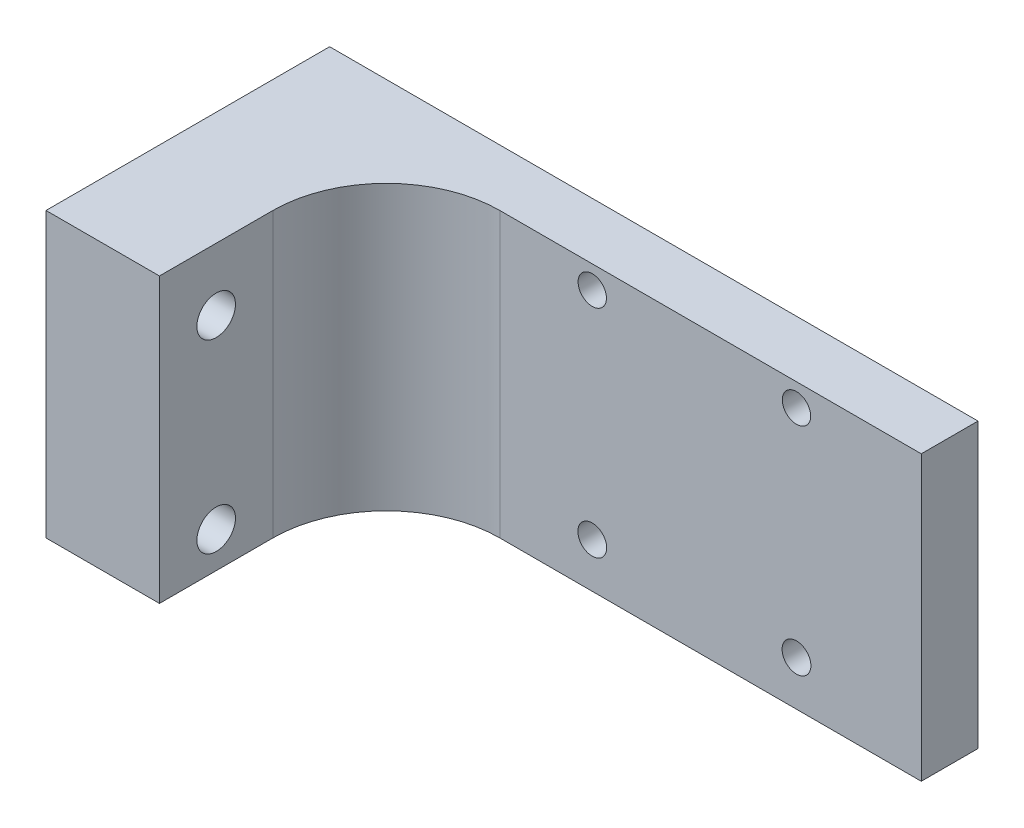
ISO-10303-21;
HEADER;
FILE_DESCRIPTION(('STEP AP214'),'2;1');
FILE_NAME('part.step','',(''),(''),'','','');
FILE_SCHEMA(('AUTOMOTIVE_DESIGN { 1 0 10303 214 1 1 1 1 }'));
ENDSEC;
DATA;
#1=APPLICATION_CONTEXT('core data for automotive mechanical design processes');
#2=APPLICATION_PROTOCOL_DEFINITION('international standard','automotive_design',2000,#1);
#3=PRODUCT_CONTEXT('',#1,'mechanical');
#4=PRODUCT('Part','Part','',(#3));
#5=PRODUCT_RELATED_PRODUCT_CATEGORY('part','',(#4));
#6=PRODUCT_DEFINITION_FORMATION('','',#4);
#7=PRODUCT_DEFINITION_CONTEXT('part definition',#1,'design');
#8=PRODUCT_DEFINITION('design','',#6,#7);
#9=PRODUCT_DEFINITION_SHAPE('','',#8);
#10=(LENGTH_UNIT() NAMED_UNIT(*) SI_UNIT(.MILLI.,.METRE.));
#11=(NAMED_UNIT(*) PLANE_ANGLE_UNIT() SI_UNIT($,.RADIAN.));
#12=(NAMED_UNIT(*) SI_UNIT($,.STERADIAN.) SOLID_ANGLE_UNIT());
#13=UNCERTAINTY_MEASURE_WITH_UNIT(LENGTH_MEASURE(1.E-05),#10,'distance_accuracy_value','');
#14=(GEOMETRIC_REPRESENTATION_CONTEXT(3) GLOBAL_UNCERTAINTY_ASSIGNED_CONTEXT((#13)) GLOBAL_UNIT_ASSIGNED_CONTEXT((#10,
#11,#12)) REPRESENTATION_CONTEXT('',''));
#15=CARTESIAN_POINT('',(0.,0.,0.));
#16=DIRECTION('',(0.,0.,1.));
#17=DIRECTION('',(1.,0.,0.));
#18=AXIS2_PLACEMENT_3D('',#15,#16,#17);
#19=CARTESIAN_POINT('',(0.,0.,5.));
#20=DIRECTION('',(1.,0.,0.));
#21=DIRECTION('',(0.,1.,0.));
#22=AXIS2_PLACEMENT_3D('',#19,#20,#21);
#23=PLANE('',#22);
#24=CARTESIAN_POINT('',(0.,-21.8349192381209,20.));
#25=DIRECTION('',(1.,0.,0.));
#26=DIRECTION('',(0.,1.,0.));
#27=AXIS2_PLACEMENT_3D('',#24,#25,#26);
#28=CIRCLE('',#27,1.7);
#29=CARTESIAN_POINT('',(0.,-20.1349192381209,20.));
#30=VERTEX_POINT('',#29);
#31=EDGE_CURVE('E120',#30,#30,#28,.T.);
#32=ORIENTED_EDGE('',*,*,#31,.T.);
#33=EDGE_LOOP('',(#32));
#34=FACE_BOUND('',#33,.T.);
#35=CARTESIAN_POINT('',(0.,-5.50310841636206,20.));
#36=DIRECTION('',(1.,0.,0.));
#37=DIRECTION('',(0.,1.,0.));
#38=AXIS2_PLACEMENT_3D('',#35,#36,#37);
#39=CIRCLE('',#38,1.7);
#40=CARTESIAN_POINT('',(0.,-3.80310841636206,20.));
#41=VERTEX_POINT('',#40);
#42=EDGE_CURVE('E279',#41,#41,#39,.T.);
#43=ORIENTED_EDGE('',*,*,#42,.T.);
#44=EDGE_LOOP('',(#43));
#45=FACE_BOUND('',#44,.T.);
#46=DIRECTION('',(0.,-1.,0.));
#47=VECTOR('',#46,1.);
#48=CARTESIAN_POINT('',(0.,0.,0.));
#49=LINE('',#48,#47);
#50=CARTESIAN_POINT('',(0.,0.,0.));
#51=VERTEX_POINT('',#50);
#52=CARTESIAN_POINT('',(0.,-25.,0.));
#53=VERTEX_POINT('',#52);
#54=EDGE_CURVE('E162',#51,#53,#49,.T.);
#55=ORIENTED_EDGE('',*,*,#54,.T.);
#56=DIRECTION('',(0.,0.,-1.));
#57=VECTOR('',#56,1.);
#58=CARTESIAN_POINT('',(0.,-25.,5.));
#59=LINE('',#58,#57);
#60=CARTESIAN_POINT('',(0.,-25.,25.));
#61=VERTEX_POINT('',#60);
#62=EDGE_CURVE('E197',#61,#53,#59,.T.);
#63=ORIENTED_EDGE('',*,*,#62,.F.);
#64=DIRECTION('',(0.,-1.,0.));
#65=VECTOR('',#64,1.);
#66=CARTESIAN_POINT('',(0.,0.,25.));
#67=LINE('',#66,#65);
#68=CARTESIAN_POINT('',(0.,0.,25.));
#69=VERTEX_POINT('',#68);
#70=EDGE_CURVE('E109',#69,#61,#67,.T.);
#71=ORIENTED_EDGE('',*,*,#70,.F.);
#72=DIRECTION('',(0.,0.,-1.));
#73=VECTOR('',#72,1.);
#74=CARTESIAN_POINT('',(0.,0.,5.));
#75=LINE('',#74,#73);
#76=EDGE_CURVE('E104',#69,#51,#75,.T.);
#77=ORIENTED_EDGE('',*,*,#76,.T.);
#78=EDGE_LOOP('',(#55,#63,#71,#77));
#79=FACE_BOUND('',#78,.T.);
#80=ADVANCED_FACE('F41',(#34,#45,#79),#23,.F.);
#81=CARTESIAN_POINT('',(0.,-25.,5.));
#82=DIRECTION('',(0.,1.,0.));
#83=DIRECTION('',(0.,0.,1.));
#84=AXIS2_PLACEMENT_3D('',#81,#82,#83);
#85=PLANE('',#84);
#86=DIRECTION('',(1.,0.,0.));
#87=VECTOR('',#86,1.);
#88=CARTESIAN_POINT('',(0.,-25.,0.));
#89=LINE('',#88,#87);
#90=CARTESIAN_POINT('',(57.15,-25.,0.));
#91=VERTEX_POINT('',#90);
#92=EDGE_CURVE('E179',#53,#91,#89,.T.);
#93=ORIENTED_EDGE('',*,*,#92,.T.);
#94=DIRECTION('',(0.,0.,-1.));
#95=VECTOR('',#94,1.);
#96=CARTESIAN_POINT('',(57.15,-25.,5.));
#97=LINE('',#96,#95);
#98=CARTESIAN_POINT('',(57.15,-25.,5.));
#99=VERTEX_POINT('',#98);
#100=EDGE_CURVE('E193',#99,#91,#97,.T.);
#101=ORIENTED_EDGE('',*,*,#100,.F.);
#102=DIRECTION('',(1.,0.,0.));
#103=VECTOR('',#102,1.);
#104=CARTESIAN_POINT('',(0.,-25.,5.));
#105=LINE('',#104,#103);
#106=CARTESIAN_POINT('',(20.,-25.,5.));
#107=VERTEX_POINT('',#106);
#108=EDGE_CURVE('E166',#107,#99,#105,.T.);
#109=ORIENTED_EDGE('',*,*,#108,.F.);
#110=CARTESIAN_POINT('',(20.,-25.,15.));
#111=DIRECTION('',(0.,1.,0.));
#112=DIRECTION('',(0.,0.,1.));
#113=AXIS2_PLACEMENT_3D('',#110,#111,#112);
#114=CIRCLE('',#113,10.);
#115=CARTESIAN_POINT('',(10.,-25.,15.));
#116=VERTEX_POINT('',#115);
#117=EDGE_CURVE('E11',#107,#116,#114,.T.);
#118=ORIENTED_EDGE('',*,*,#117,.T.);
#119=DIRECTION('',(0.,0.,-1.));
#120=VECTOR('',#119,1.);
#121=CARTESIAN_POINT('',(10.,-25.,25.));
#122=LINE('',#121,#120);
#123=CARTESIAN_POINT('',(10.,-25.,25.));
#124=VERTEX_POINT('',#123);
#125=EDGE_CURVE('E128',#124,#116,#122,.T.);
#126=ORIENTED_EDGE('',*,*,#125,.F.);
#127=DIRECTION('',(1.,0.,0.));
#128=VECTOR('',#127,1.);
#129=CARTESIAN_POINT('',(0.,-25.,25.));
#130=LINE('',#129,#128);
#131=EDGE_CURVE('E115',#61,#124,#130,.T.);
#132=ORIENTED_EDGE('',*,*,#131,.F.);
#133=ORIENTED_EDGE('',*,*,#62,.T.);
#134=EDGE_LOOP('',(#93,#101,#109,#118,#126,#132,#133));
#135=FACE_BOUND('',#134,.T.);
#136=ADVANCED_FACE('F206',(#135),#85,.F.);
#137=CARTESIAN_POINT('',(57.15,0.,5.));
#138=DIRECTION('',(-1.,0.,0.));
#139=DIRECTION('',(0.,0.,1.));
#140=AXIS2_PLACEMENT_3D('',#137,#138,#139);
#141=PLANE('',#140);
#142=DIRECTION('',(0.,1.,0.));
#143=VECTOR('',#142,1.);
#144=CARTESIAN_POINT('',(57.15,0.,0.));
#145=LINE('',#144,#143);
#146=CARTESIAN_POINT('',(57.15,0.,0.));
#147=VERTEX_POINT('',#146);
#148=EDGE_CURVE('E182',#91,#147,#145,.T.);
#149=ORIENTED_EDGE('',*,*,#148,.T.);
#150=DIRECTION('',(0.,0.,-1.));
#151=VECTOR('',#150,1.);
#152=CARTESIAN_POINT('',(57.15,0.,5.));
#153=LINE('',#152,#151);
#154=CARTESIAN_POINT('',(57.15,0.,5.));
#155=VERTEX_POINT('',#154);
#156=EDGE_CURVE('E189',#155,#147,#153,.T.);
#157=ORIENTED_EDGE('',*,*,#156,.F.);
#158=DIRECTION('',(0.,1.,0.));
#159=VECTOR('',#158,1.);
#160=CARTESIAN_POINT('',(57.15,0.,5.));
#161=LINE('',#160,#159);
#162=EDGE_CURVE('E169',#99,#155,#161,.T.);
#163=ORIENTED_EDGE('',*,*,#162,.F.);
#164=ORIENTED_EDGE('',*,*,#100,.T.);
#165=EDGE_LOOP('',(#149,#157,#163,#164));
#166=FACE_BOUND('',#165,.T.);
#167=ADVANCED_FACE('F216',(#166),#141,.F.);
#168=CARTESIAN_POINT('',(0.,0.,5.));
#169=DIRECTION('',(0.,-1.,0.));
#170=DIRECTION('',(0.,0.,-1.));
#171=AXIS2_PLACEMENT_3D('',#168,#169,#170);
#172=PLANE('',#171);
#173=DIRECTION('',(-1.,0.,0.));
#174=VECTOR('',#173,1.);
#175=CARTESIAN_POINT('',(0.,0.,0.));
#176=LINE('',#175,#174);
#177=EDGE_CURVE('E170',#147,#51,#176,.T.);
#178=ORIENTED_EDGE('',*,*,#177,.T.);
#179=ORIENTED_EDGE('',*,*,#76,.F.);
#180=DIRECTION('',(-1.,0.,0.));
#181=VECTOR('',#180,1.);
#182=CARTESIAN_POINT('',(0.,0.,25.));
#183=LINE('',#182,#181);
#184=CARTESIAN_POINT('',(10.,0.,25.));
#185=VERTEX_POINT('',#184);
#186=EDGE_CURVE('E98',#185,#69,#183,.T.);
#187=ORIENTED_EDGE('',*,*,#186,.F.);
#188=DIRECTION('',(0.,0.,-1.));
#189=VECTOR('',#188,1.);
#190=CARTESIAN_POINT('',(10.,0.,25.));
#191=LINE('',#190,#189);
#192=CARTESIAN_POINT('',(10.,0.,15.));
#193=VERTEX_POINT('',#192);
#194=EDGE_CURVE('E102',#185,#193,#191,.T.);
#195=ORIENTED_EDGE('',*,*,#194,.T.);
#196=CARTESIAN_POINT('',(20.,0.,15.));
#197=DIRECTION('',(0.,-1.,0.));
#198=DIRECTION('',(0.,0.,-1.));
#199=AXIS2_PLACEMENT_3D('',#196,#197,#198);
#200=CIRCLE('',#199,10.);
#201=CARTESIAN_POINT('',(20.,0.,5.));
#202=VERTEX_POINT('',#201);
#203=EDGE_CURVE('E50',#193,#202,#200,.T.);
#204=ORIENTED_EDGE('',*,*,#203,.T.);
#205=DIRECTION('',(-1.,0.,0.));
#206=VECTOR('',#205,1.);
#207=CARTESIAN_POINT('',(0.,0.,5.));
#208=LINE('',#207,#206);
#209=EDGE_CURVE('E173',#155,#202,#208,.T.);
#210=ORIENTED_EDGE('',*,*,#209,.F.);
#211=ORIENTED_EDGE('',*,*,#156,.T.);
#212=EDGE_LOOP('',(#178,#179,#187,#195,#204,#210,#211));
#213=FACE_BOUND('',#212,.T.);
#214=ADVANCED_FACE('F100',(#213),#172,.F.);
#215=CARTESIAN_POINT('',(0.,0.,5.));
#216=DIRECTION('',(0.,0.,1.));
#217=DIRECTION('',(1.,0.,0.));
#218=AXIS2_PLACEMENT_3D('',#215,#216,#217);
#219=PLANE('',#218);
#220=ORIENTED_EDGE('',*,*,#209,.T.);
#221=DIRECTION('',(0.,1.,0.));
#222=VECTOR('',#221,1.);
#223=CARTESIAN_POINT('',(20.,0.,5.));
#224=LINE('',#223,#222);
#225=EDGE_CURVE('E63',#202,#107,#224,.F.);
#226=ORIENTED_EDGE('',*,*,#225,.T.);
#227=ORIENTED_EDGE('',*,*,#108,.T.);
#228=ORIENTED_EDGE('',*,*,#162,.T.);
#229=EDGE_LOOP('',(#220,#226,#227,#228));
#230=FACE_BOUND('',#229,.T.);
#231=CARTESIAN_POINT('',(46.15,-2.,5.));
#232=DIRECTION('',(0.,0.,1.));
#233=DIRECTION('',(1.,0.,0.));
#234=AXIS2_PLACEMENT_3D('',#231,#232,#233);
#235=CIRCLE('',#234,1.25);
#236=CARTESIAN_POINT('',(47.4,-2.,5.));
#237=VERTEX_POINT('',#236);
#238=EDGE_CURVE('E147',#237,#237,#235,.T.);
#239=ORIENTED_EDGE('',*,*,#238,.F.);
#240=EDGE_LOOP('',(#239));
#241=FACE_BOUND('',#240,.T.);
#242=CARTESIAN_POINT('',(28.15,-21.05,5.));
#243=DIRECTION('',(0.,0.,1.));
#244=DIRECTION('',(1.,0.,0.));
#245=AXIS2_PLACEMENT_3D('',#242,#243,#244);
#246=CIRCLE('',#245,1.27);
#247=CARTESIAN_POINT('',(29.42,-21.05,5.));
#248=VERTEX_POINT('',#247);
#249=EDGE_CURVE('E140',#248,#248,#246,.T.);
#250=ORIENTED_EDGE('',*,*,#249,.F.);
#251=EDGE_LOOP('',(#250));
#252=FACE_BOUND('',#251,.T.);
#253=CARTESIAN_POINT('',(46.15,-21.05,5.));
#254=DIRECTION('',(0.,0.,1.));
#255=DIRECTION('',(1.,0.,0.));
#256=AXIS2_PLACEMENT_3D('',#253,#254,#255);
#257=CIRCLE('',#256,1.27);
#258=CARTESIAN_POINT('',(47.42,-21.05,5.));
#259=VERTEX_POINT('',#258);
#260=EDGE_CURVE('E127',#259,#259,#257,.T.);
#261=ORIENTED_EDGE('',*,*,#260,.F.);
#262=EDGE_LOOP('',(#261));
#263=FACE_BOUND('',#262,.T.);
#264=CARTESIAN_POINT('',(28.15,-2.,5.));
#265=DIRECTION('',(0.,0.,1.));
#266=DIRECTION('',(1.,0.,0.));
#267=AXIS2_PLACEMENT_3D('',#264,#265,#266);
#268=CIRCLE('',#267,1.25);
#269=CARTESIAN_POINT('',(29.4,-2.,5.));
#270=VERTEX_POINT('',#269);
#271=EDGE_CURVE('E146',#270,#270,#268,.T.);
#272=ORIENTED_EDGE('',*,*,#271,.F.);
#273=EDGE_LOOP('',(#272));
#274=FACE_BOUND('',#273,.T.);
#275=ADVANCED_FACE('F218',(#230,#241,#252,#263,#274),#219,.T.);
#276=CARTESIAN_POINT('',(0.,0.,0.));
#277=DIRECTION('',(0.,0.,1.));
#278=DIRECTION('',(1.,0.,0.));
#279=AXIS2_PLACEMENT_3D('',#276,#277,#278);
#280=PLANE('',#279);
#281=CARTESIAN_POINT('',(46.15,-2.,0.));
#282=DIRECTION('',(0.,0.,1.));
#283=DIRECTION('',(1.,0.,0.));
#284=AXIS2_PLACEMENT_3D('',#281,#282,#283);
#285=CIRCLE('',#284,1.25);
#286=CARTESIAN_POINT('',(47.4,-2.,0.));
#287=VERTEX_POINT('',#286);
#288=EDGE_CURVE('E142',#287,#287,#285,.T.);
#289=ORIENTED_EDGE('',*,*,#288,.T.);
#290=EDGE_LOOP('',(#289));
#291=FACE_BOUND('',#290,.T.);
#292=CARTESIAN_POINT('',(28.15,-21.05,0.));
#293=DIRECTION('',(0.,0.,1.));
#294=DIRECTION('',(1.,0.,0.));
#295=AXIS2_PLACEMENT_3D('',#292,#293,#294);
#296=CIRCLE('',#295,1.27);
#297=CARTESIAN_POINT('',(29.42,-21.05,0.));
#298=VERTEX_POINT('',#297);
#299=EDGE_CURVE('E151',#298,#298,#296,.T.);
#300=ORIENTED_EDGE('',*,*,#299,.T.);
#301=EDGE_LOOP('',(#300));
#302=FACE_BOUND('',#301,.T.);
#303=CARTESIAN_POINT('',(46.15,-21.05,0.));
#304=DIRECTION('',(0.,0.,1.));
#305=DIRECTION('',(1.,0.,0.));
#306=AXIS2_PLACEMENT_3D('',#303,#304,#305);
#307=CIRCLE('',#306,1.27);
#308=CARTESIAN_POINT('',(47.42,-21.05,0.));
#309=VERTEX_POINT('',#308);
#310=EDGE_CURVE('E133',#309,#309,#307,.T.);
#311=ORIENTED_EDGE('',*,*,#310,.T.);
#312=EDGE_LOOP('',(#311));
#313=FACE_BOUND('',#312,.T.);
#314=CARTESIAN_POINT('',(28.15,-2.,0.));
#315=DIRECTION('',(0.,0.,1.));
#316=DIRECTION('',(1.,0.,0.));
#317=AXIS2_PLACEMENT_3D('',#314,#315,#316);
#318=CIRCLE('',#317,1.25);
#319=CARTESIAN_POINT('',(29.4,-2.,0.));
#320=VERTEX_POINT('',#319);
#321=EDGE_CURVE('E158',#320,#320,#318,.T.);
#322=ORIENTED_EDGE('',*,*,#321,.T.);
#323=EDGE_LOOP('',(#322));
#324=FACE_BOUND('',#323,.T.);
#325=ORIENTED_EDGE('',*,*,#54,.F.);
#326=ORIENTED_EDGE('',*,*,#177,.F.);
#327=ORIENTED_EDGE('',*,*,#148,.F.);
#328=ORIENTED_EDGE('',*,*,#92,.F.);
#329=EDGE_LOOP('',(#325,#326,#327,#328));
#330=FACE_BOUND('',#329,.T.);
#331=ADVANCED_FACE('F212',(#291,#302,#313,#324,#330),#280,.F.);
#332=CARTESIAN_POINT('',(28.15,-2.,0.));
#333=DIRECTION('',(0.,0.,1.));
#334=DIRECTION('',(1.,0.,0.));
#335=AXIS2_PLACEMENT_3D('',#332,#333,#334);
#336=CYLINDRICAL_SURFACE('',#335,1.25);
#337=ORIENTED_EDGE('',*,*,#321,.F.);
#338=EDGE_LOOP('',(#337));
#339=FACE_BOUND('',#338,.T.);
#340=ORIENTED_EDGE('',*,*,#271,.T.);
#341=EDGE_LOOP('',(#340));
#342=FACE_BOUND('',#341,.T.);
#343=ADVANCED_FACE('F247',(#339,#342),#336,.F.);
#344=CARTESIAN_POINT('',(46.15,-21.05,0.));
#345=DIRECTION('',(0.,0.,1.));
#346=DIRECTION('',(1.,0.,0.));
#347=AXIS2_PLACEMENT_3D('',#344,#345,#346);
#348=CYLINDRICAL_SURFACE('',#347,1.27);
#349=ORIENTED_EDGE('',*,*,#310,.F.);
#350=EDGE_LOOP('',(#349));
#351=FACE_BOUND('',#350,.T.);
#352=ORIENTED_EDGE('',*,*,#260,.T.);
#353=EDGE_LOOP('',(#352));
#354=FACE_BOUND('',#353,.T.);
#355=ADVANCED_FACE('F253',(#351,#354),#348,.F.);
#356=CARTESIAN_POINT('',(28.15,-21.05,0.));
#357=DIRECTION('',(0.,0.,1.));
#358=DIRECTION('',(1.,0.,0.));
#359=AXIS2_PLACEMENT_3D('',#356,#357,#358);
#360=CYLINDRICAL_SURFACE('',#359,1.27);
#361=ORIENTED_EDGE('',*,*,#299,.F.);
#362=EDGE_LOOP('',(#361));
#363=FACE_BOUND('',#362,.T.);
#364=ORIENTED_EDGE('',*,*,#249,.T.);
#365=EDGE_LOOP('',(#364));
#366=FACE_BOUND('',#365,.T.);
#367=ADVANCED_FACE('F255',(#363,#366),#360,.F.);
#368=CARTESIAN_POINT('',(46.15,-2.,0.));
#369=DIRECTION('',(0.,0.,1.));
#370=DIRECTION('',(1.,0.,0.));
#371=AXIS2_PLACEMENT_3D('',#368,#369,#370);
#372=CYLINDRICAL_SURFACE('',#371,1.25);
#373=ORIENTED_EDGE('',*,*,#288,.F.);
#374=EDGE_LOOP('',(#373));
#375=FACE_BOUND('',#374,.T.);
#376=ORIENTED_EDGE('',*,*,#238,.T.);
#377=EDGE_LOOP('',(#376));
#378=FACE_BOUND('',#377,.T.);
#379=ADVANCED_FACE('F258',(#375,#378),#372,.F.);
#380=CARTESIAN_POINT('',(10.,0.,25.));
#381=DIRECTION('',(-1.,0.,0.));
#382=DIRECTION('',(0.,-1.,0.));
#383=AXIS2_PLACEMENT_3D('',#380,#381,#382);
#384=PLANE('',#383);
#385=CARTESIAN_POINT('',(10.,-21.8349192381209,20.));
#386=DIRECTION('',(1.,0.,0.));
#387=DIRECTION('',(0.,1.,0.));
#388=AXIS2_PLACEMENT_3D('',#385,#386,#387);
#389=CIRCLE('',#388,1.7);
#390=CARTESIAN_POINT('',(10.,-20.1349192381209,20.));
#391=VERTEX_POINT('',#390);
#392=EDGE_CURVE('E277',#391,#391,#389,.T.);
#393=ORIENTED_EDGE('',*,*,#392,.F.);
#394=EDGE_LOOP('',(#393));
#395=FACE_BOUND('',#394,.T.);
#396=CARTESIAN_POINT('',(10.,-5.50310841636205,20.));
#397=DIRECTION('',(1.,0.,0.));
#398=DIRECTION('',(0.,1.,0.));
#399=AXIS2_PLACEMENT_3D('',#396,#397,#398);
#400=CIRCLE('',#399,1.7);
#401=CARTESIAN_POINT('',(10.,-3.80310841636205,20.));
#402=VERTEX_POINT('',#401);
#403=EDGE_CURVE('E285',#402,#402,#400,.T.);
#404=ORIENTED_EDGE('',*,*,#403,.F.);
#405=EDGE_LOOP('',(#404));
#406=FACE_BOUND('',#405,.T.);
#407=ORIENTED_EDGE('',*,*,#125,.T.);
#408=DIRECTION('',(0.,1.,0.));
#409=VECTOR('',#408,1.);
#410=CARTESIAN_POINT('',(10.,0.,15.));
#411=LINE('',#410,#409);
#412=EDGE_CURVE('E125',#116,#193,#411,.T.);
#413=ORIENTED_EDGE('',*,*,#412,.T.);
#414=ORIENTED_EDGE('',*,*,#194,.F.);
#415=DIRECTION('',(0.,1.,0.));
#416=VECTOR('',#415,1.);
#417=CARTESIAN_POINT('',(10.,0.,25.));
#418=LINE('',#417,#416);
#419=EDGE_CURVE('E110',#124,#185,#418,.T.);
#420=ORIENTED_EDGE('',*,*,#419,.F.);
#421=EDGE_LOOP('',(#407,#413,#414,#420));
#422=FACE_BOUND('',#421,.T.);
#423=ADVANCED_FACE('F123',(#395,#406,#422),#384,.F.);
#424=CARTESIAN_POINT('',(0.,0.,25.));
#425=DIRECTION('',(0.,0.,1.));
#426=DIRECTION('',(1.,0.,0.));
#427=AXIS2_PLACEMENT_3D('',#424,#425,#426);
#428=PLANE('',#427);
#429=ORIENTED_EDGE('',*,*,#419,.T.);
#430=ORIENTED_EDGE('',*,*,#186,.T.);
#431=ORIENTED_EDGE('',*,*,#70,.T.);
#432=ORIENTED_EDGE('',*,*,#131,.T.);
#433=EDGE_LOOP('',(#429,#430,#431,#432));
#434=FACE_BOUND('',#433,.T.);
#435=ADVANCED_FACE('F113',(#434),#428,.T.);
#436=CARTESIAN_POINT('',(20.,0.,15.));
#437=DIRECTION('',(0.,1.,0.));
#438=DIRECTION('',(-1.,0.,0.));
#439=AXIS2_PLACEMENT_3D('',#436,#437,#438);
#440=CYLINDRICAL_SURFACE('',#439,10.);
#441=ORIENTED_EDGE('',*,*,#117,.F.);
#442=ORIENTED_EDGE('',*,*,#225,.F.);
#443=ORIENTED_EDGE('',*,*,#203,.F.);
#444=ORIENTED_EDGE('',*,*,#412,.F.);
#445=EDGE_LOOP('',(#441,#442,#443,#444));
#446=FACE_BOUND('',#445,.T.);
#447=ADVANCED_FACE('F43',(#446),#440,.F.);
#448=CARTESIAN_POINT('',(0.,-5.50310841636206,20.));
#449=DIRECTION('',(1.,0.,0.));
#450=DIRECTION('',(0.,1.,0.));
#451=AXIS2_PLACEMENT_3D('',#448,#449,#450);
#452=CYLINDRICAL_SURFACE('',#451,1.7);
#453=ORIENTED_EDGE('',*,*,#42,.F.);
#454=EDGE_LOOP('',(#453));
#455=FACE_BOUND('',#454,.T.);
#456=ORIENTED_EDGE('',*,*,#403,.T.);
#457=EDGE_LOOP('',(#456));
#458=FACE_BOUND('',#457,.T.);
#459=ADVANCED_FACE('F223',(#455,#458),#452,.F.);
#460=CARTESIAN_POINT('',(0.,-21.8349192381209,20.));
#461=DIRECTION('',(1.,0.,0.));
#462=DIRECTION('',(0.,1.,0.));
#463=AXIS2_PLACEMENT_3D('',#460,#461,#462);
#464=CYLINDRICAL_SURFACE('',#463,1.7);
#465=ORIENTED_EDGE('',*,*,#31,.F.);
#466=EDGE_LOOP('',(#465));
#467=FACE_BOUND('',#466,.T.);
#468=ORIENTED_EDGE('',*,*,#392,.T.);
#469=EDGE_LOOP('',(#468));
#470=FACE_BOUND('',#469,.T.);
#471=ADVANCED_FACE('F228',(#467,#470),#464,.F.);
#472=CLOSED_SHELL('',(#80,#136,#167,#214,#275,#331,#343,#355,#367,#379,#423,#435,#447,#459,#471));
#473=MANIFOLD_SOLID_BREP('B2',#472);
#474=ADVANCED_BREP_SHAPE_REPRESENTATION('',(#18,#473),#14);
#475=SHAPE_DEFINITION_REPRESENTATION(#9,#474);
ENDSEC;
END-ISO-10303-21;
